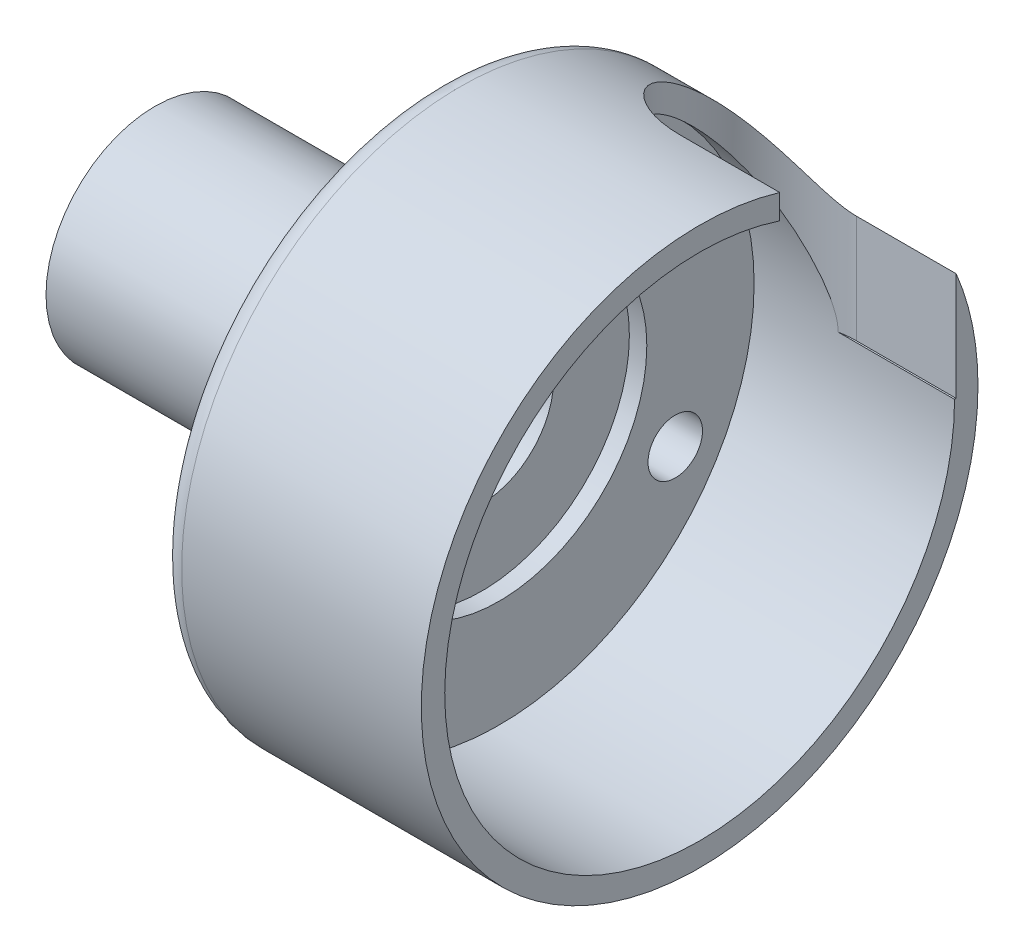
ISO-10303-21;
HEADER;
FILE_DESCRIPTION(('STEP AP214'),'2;1');
FILE_NAME('part.step','',(''),(''),'','','');
FILE_SCHEMA(('AUTOMOTIVE_DESIGN { 1 0 10303 214 1 1 1 1 }'));
ENDSEC;
DATA;
#1=APPLICATION_CONTEXT('core data for automotive mechanical design processes');
#2=APPLICATION_PROTOCOL_DEFINITION('international standard','automotive_design',2000,#1);
#3=PRODUCT_CONTEXT('',#1,'mechanical');
#4=PRODUCT('Part','Part','',(#3));
#5=PRODUCT_RELATED_PRODUCT_CATEGORY('part','',(#4));
#6=PRODUCT_DEFINITION_FORMATION('','',#4);
#7=PRODUCT_DEFINITION_CONTEXT('part definition',#1,'design');
#8=PRODUCT_DEFINITION('design','',#6,#7);
#9=PRODUCT_DEFINITION_SHAPE('','',#8);
#10=(LENGTH_UNIT() NAMED_UNIT(*) SI_UNIT(.MILLI.,.METRE.));
#11=(NAMED_UNIT(*) PLANE_ANGLE_UNIT() SI_UNIT($,.RADIAN.));
#12=(NAMED_UNIT(*) SI_UNIT($,.STERADIAN.) SOLID_ANGLE_UNIT());
#13=UNCERTAINTY_MEASURE_WITH_UNIT(LENGTH_MEASURE(1.E-05),#10,'distance_accuracy_value','');
#14=(GEOMETRIC_REPRESENTATION_CONTEXT(3) GLOBAL_UNCERTAINTY_ASSIGNED_CONTEXT((#13)) GLOBAL_UNIT_ASSIGNED_CONTEXT((#10,
#11,#12)) REPRESENTATION_CONTEXT('',''));
#15=CARTESIAN_POINT('',(0.,0.,0.));
#16=DIRECTION('',(0.,0.,1.));
#17=DIRECTION('',(1.,0.,0.));
#18=AXIS2_PLACEMENT_3D('',#15,#16,#17);
#19=CARTESIAN_POINT('',(-5.,0.,0.));
#20=DIRECTION('',(1.,0.,0.));
#21=DIRECTION('',(0.,0.,-1.));
#22=AXIS2_PLACEMENT_3D('',#19,#20,#21);
#23=CYLINDRICAL_SURFACE('',#22,3.3);
#24=CARTESIAN_POINT('',(10.,0.,0.));
#25=DIRECTION('',(1.,0.,0.));
#26=DIRECTION('',(0.,0.,-1.));
#27=AXIS2_PLACEMENT_3D('',#24,#25,#26);
#28=CIRCLE('',#27,3.3);
#29=CARTESIAN_POINT('',(10.,0.,-3.3));
#30=VERTEX_POINT('',#29);
#31=EDGE_CURVE('E241',#30,#30,#28,.T.);
#32=ORIENTED_EDGE('',*,*,#31,.T.);
#33=EDGE_LOOP('',(#32));
#34=FACE_BOUND('',#33,.T.);
#35=CARTESIAN_POINT('',(9.00000000000001,0.,0.));
#36=DIRECTION('',(-1.,0.,0.));
#37=DIRECTION('',(0.,0.,1.));
#38=AXIS2_PLACEMENT_3D('',#35,#36,#37);
#39=CIRCLE('',#38,3.3);
#40=CARTESIAN_POINT('',(9.00000000000001,0.,3.3));
#41=VERTEX_POINT('',#40);
#42=EDGE_CURVE('E65',#41,#41,#39,.F.);
#43=ORIENTED_EDGE('',*,*,#42,.F.);
#44=EDGE_LOOP('',(#43));
#45=FACE_BOUND('',#44,.T.);
#46=ADVANCED_FACE('F61',(#34,#45),#23,.F.);
#47=CARTESIAN_POINT('',(20.,0.,0.));
#48=DIRECTION('',(1.,0.,0.));
#49=DIRECTION('',(0.,0.,-1.));
#50=AXIS2_PLACEMENT_3D('',#47,#48,#49);
#51=PLANE('',#50);
#52=CARTESIAN_POINT('',(20.,0.,0.));
#53=DIRECTION('',(1.,0.,0.));
#54=DIRECTION('',(0.,0.,-1.));
#55=AXIS2_PLACEMENT_3D('',#52,#53,#54);
#56=CIRCLE('',#55,11.7);
#57=CARTESIAN_POINT('',(20.,11.1078519525604,-3.675));
#58=VERTEX_POINT('',#57);
#59=CARTESIAN_POINT('',(20.,0.,-11.7));
#60=VERTEX_POINT('',#59);
#61=EDGE_CURVE('E436',#58,#60,#56,.T.);
#62=ORIENTED_EDGE('',*,*,#61,.F.);
#63=DIRECTION('',(0.,-1.,0.));
#64=VECTOR('',#63,1.);
#65=CARTESIAN_POINT('',(20.,16.,-3.675));
#66=LINE('',#65,#64);
#67=CARTESIAN_POINT('',(20.,12.234990805064,-3.675));
#68=VERTEX_POINT('',#67);
#69=EDGE_CURVE('E127',#68,#58,#66,.T.);
#70=ORIENTED_EDGE('',*,*,#69,.F.);
#71=CARTESIAN_POINT('',(20.,0.,0.));
#72=DIRECTION('',(1.,0.,0.));
#73=DIRECTION('',(0.,0.,-1.));
#74=AXIS2_PLACEMENT_3D('',#71,#72,#73);
#75=CIRCLE('',#74,12.775);
#76=CARTESIAN_POINT('',(20.,4.954795656735,-11.775));
#77=VERTEX_POINT('',#76);
#78=EDGE_CURVE('E126',#68,#77,#75,.T.);
#79=ORIENTED_EDGE('',*,*,#78,.T.);
#80=DIRECTION('',(0.,-1.,0.));
#81=VECTOR('',#80,1.);
#82=CARTESIAN_POINT('',(20.,16.,-11.775));
#83=LINE('',#82,#81);
#84=CARTESIAN_POINT('',(20.,0.,-11.775));
#85=VERTEX_POINT('',#84);
#86=EDGE_CURVE('E119',#77,#85,#83,.T.);
#87=ORIENTED_EDGE('',*,*,#86,.T.);
#88=DIRECTION('',(0.,0.,1.));
#89=VECTOR('',#88,1.);
#90=CARTESIAN_POINT('',(20.,0.,-11.775));
#91=LINE('',#90,#89);
#92=EDGE_CURVE('E107',#85,#60,#91,.T.);
#93=ORIENTED_EDGE('',*,*,#92,.T.);
#94=EDGE_LOOP('',(#62,#70,#79,#87,#93));
#95=FACE_BOUND('',#94,.T.);
#96=ADVANCED_FACE('F123',(#95),#51,.T.);
#97=CARTESIAN_POINT('',(-22.2925973595304,0.,0.));
#98=DIRECTION('',(1.,0.,0.));
#99=DIRECTION('',(0.,0.,-1.));
#100=AXIS2_PLACEMENT_3D('',#97,#98,#99);
#101=CYLINDRICAL_SURFACE('',#100,11.7);
#102=CARTESIAN_POINT('',(10.8,0.,0.));
#103=DIRECTION('',(1.,0.,0.));
#104=DIRECTION('',(0.,0.,-1.));
#105=AXIS2_PLACEMENT_3D('',#102,#103,#104);
#106=CIRCLE('',#105,11.7);
#107=CARTESIAN_POINT('',(10.8,0.,-11.7));
#108=VERTEX_POINT('',#107);
#109=EDGE_CURVE('E437',#108,#108,#106,.F.);
#110=ORIENTED_EDGE('',*,*,#109,.T.);
#111=EDGE_LOOP('',(#110));
#112=FACE_BOUND('',#111,.T.);
#113=DIRECTION('',(1.,0.,0.));
#114=VECTOR('',#113,1.);
#115=CARTESIAN_POINT('',(-22.2925973595304,11.1078519525604,-3.675));
#116=LINE('',#115,#114);
#117=CARTESIAN_POINT('',(15.4300719305149,11.1078519525604,-3.675));
#118=VERTEX_POINT('',#117);
#119=EDGE_CURVE('E12',#58,#118,#116,.F.);
#120=ORIENTED_EDGE('',*,*,#119,.F.);
#121=ORIENTED_EDGE('',*,*,#61,.T.);
#122=DIRECTION('',(1.,0.,0.));
#123=VECTOR('',#122,1.);
#124=CARTESIAN_POINT('',(-22.2925973595304,0.,-11.7));
#125=LINE('',#124,#123);
#126=CARTESIAN_POINT('',(14.6542658980557,0.,-11.7));
#127=VERTEX_POINT('',#126);
#128=EDGE_CURVE('E112',#127,#60,#125,.T.);
#129=ORIENTED_EDGE('',*,*,#128,.F.);
#130=CARTESIAN_POINT('',(15.4300719305149,11.1078519525604,-3.675));
#131=CARTESIAN_POINT('',(15.321874357469,11.1078448137557,-3.67498552687792));
#132=CARTESIAN_POINT('',(15.2136782804234,11.1064172853442,-3.67933520948674));
#133=CARTESIAN_POINT('',(14.9980606494924,11.1006696657326,-3.69665890445622));
#134=CARTESIAN_POINT('',(14.8906390620478,11.0963497006348,-3.70963254083601));
#135=CARTESIAN_POINT('',(14.6774242912556,11.0847704243369,-3.74408532582627));
#136=CARTESIAN_POINT('',(14.5716297842871,11.0775136495638,-3.76555713449037));
#137=CARTESIAN_POINT('',(14.3623289609946,11.0599628707838,-3.81679957797082));
#138=CARTESIAN_POINT('',(14.2588226097493,11.049668913164,-3.84657008604012));
#139=CARTESIAN_POINT('',(14.0547931684851,11.0259147585262,-3.91413900220891));
#140=CARTESIAN_POINT('',(13.9542712375576,11.0124533489881,-3.95194048407501));
#141=CARTESIAN_POINT('',(13.7569264810491,10.9822151758271,-4.0352089751864));
#142=CARTESIAN_POINT('',(13.6601050264642,10.965437197383,-4.08067879235641));
#143=CARTESIAN_POINT('',(13.4709421983971,10.9284269946721,-4.17878309954883));
#144=CARTESIAN_POINT('',(13.3785976941289,10.9081972303655,-4.23141248183622));
#145=CARTESIAN_POINT('',(13.1989062753842,10.8641149774511,-4.34334239082116));
#146=CARTESIAN_POINT('',(13.1115612094694,10.8402611605978,-4.40264536136992));
#147=CARTESIAN_POINT('',(12.9423726209153,10.7887708307644,-4.52735884454252));
#148=CARTESIAN_POINT('',(12.8605353188507,10.7611301442932,-4.59277607002198));
#149=CARTESIAN_POINT('',(12.7029250624789,10.7019664310599,-4.72899872870154));
#150=CARTESIAN_POINT('',(12.6271543043419,10.6704420087244,-4.79980609527089));
#151=CARTESIAN_POINT('',(12.482118970827,10.6034547126697,-4.94602985375144));
#152=CARTESIAN_POINT('',(12.4128529538663,10.5679927154171,-5.02144521829218));
#153=CARTESIAN_POINT('',(12.2810741934953,10.4930870709412,-5.17614852903445));
#154=CARTESIAN_POINT('',(12.2185639855313,10.4536419395217,-5.25543791305136));
#155=CARTESIAN_POINT('',(12.0988340776575,10.3696272488956,-5.41936730125553));
#156=CARTESIAN_POINT('',(12.0418142838359,10.3249442200007,-5.50409523771966));
#157=CARTESIAN_POINT('',(11.9352006229624,10.231481696717,-5.67594740760889));
#158=CARTESIAN_POINT('',(11.8856094577103,10.1827007219203,-5.76307249931097));
#159=CARTESIAN_POINT('',(11.7479919389348,10.0304128845363,-6.02675993975707));
#160=CARTESIAN_POINT('',(11.6710341065358,9.92089946784347,-6.20575651932947));
#161=CARTESIAN_POINT('',(11.53921610847,9.67611794763069,-6.58163404240134));
#162=CARTESIAN_POINT('',(11.4872578914085,9.53937796679476,-6.7785498304953));
#163=CARTESIAN_POINT('',(11.4138077394232,9.25101562171613,-7.16709855321967));
#164=CARTESIAN_POINT('',(11.3923345402653,9.09938416647827,-7.35872816815356));
#165=CARTESIAN_POINT('',(11.3776043255917,8.81910089336532,-7.69088323482363));
#166=CARTESIAN_POINT('',(11.379124453972,8.69286147619829,-7.83327815203036));
#167=CARTESIAN_POINT('',(11.3961354997653,8.43398843227,-8.11134514872891));
#168=CARTESIAN_POINT('',(11.411632545795,8.30135202469889,-8.24701425154406));
#169=CARTESIAN_POINT('',(11.4548337419917,8.03040139340595,-8.5110832104586));
#170=CARTESIAN_POINT('',(11.4825651007312,7.89207514101251,-8.63946614007853));
#171=CARTESIAN_POINT('',(11.5485755572088,7.61085413971097,-8.88820294958323));
#172=CARTESIAN_POINT('',(11.5868545588686,7.46795943242737,-9.0085569025915));
#173=CARTESIAN_POINT('',(11.6922648875331,7.11135313798653,-9.2947484208774));
#174=CARTESIAN_POINT('',(11.7645568598733,6.89541200487178,-9.4559236479076));
#175=CARTESIAN_POINT('',(11.9246003485401,6.45688903981087,-9.76063319470439));
#176=CARTESIAN_POINT('',(12.0123595813919,6.23430393948547,-9.90415864813986));
#177=CARTESIAN_POINT('',(12.2000435751838,5.78391399409746,-10.1737505484756));
#178=CARTESIAN_POINT('',(12.2999647888715,5.55611068667703,-10.2998220632982));
#179=CARTESIAN_POINT('',(12.5092163718453,5.09621124956749,-10.534957449911));
#180=CARTESIAN_POINT('',(12.6185446722719,4.86411607254096,-10.6440250465372));
#181=CARTESIAN_POINT('',(12.8277125089724,4.43033637143341,-10.8309495438246));
#182=CARTESIAN_POINT('',(12.9266114998205,4.22915167930686,-10.9110384456941));
#183=CARTESIAN_POINT('',(13.1280007184286,3.82425218293121,-11.0594573665479));
#184=CARTESIAN_POINT('',(13.2304911087491,3.62053726442442,-11.1277868524259));
#185=CARTESIAN_POINT('',(13.4377113527418,3.2098726704605,-11.2531313742553));
#186=CARTESIAN_POINT('',(13.5424475670153,3.00291443440759,-11.3101076747649));
#187=CARTESIAN_POINT('',(13.751580027422,2.58608148099421,-11.412636979699));
#188=CARTESIAN_POINT('',(13.8559763679308,2.37620767713658,-11.458193480607));
#189=CARTESIAN_POINT('',(14.0163476692944,2.04379096285069,-11.5207603221632));
#190=CARTESIAN_POINT('',(14.0737703418485,1.92266038120232,-11.5416039116953));
#191=CARTESIAN_POINT('',(14.1859228431972,1.67859844764865,-11.5796186953345));
#192=CARTESIAN_POINT('',(14.2406531601851,1.55566742749431,-11.5967905571242));
#193=CARTESIAN_POINT('',(14.3448221704693,1.30849268850074,-11.6272613762697));
#194=CARTESIAN_POINT('',(14.3943068691404,1.18427311777827,-11.6405961397017));
#195=CARTESIAN_POINT('',(14.4849762527032,0.932561413433722,-11.6634595495844));
#196=CARTESIAN_POINT('',(14.5261714410956,0.805073654890283,-11.6729930278154));
#197=CARTESIAN_POINT('',(14.5889900223494,0.565989043937799,-11.6868145682267));
#198=CARTESIAN_POINT('',(14.612659380525,0.454999146570424,-11.6916873191988));
#199=CARTESIAN_POINT('',(14.6371821680639,0.286193464371981,-11.6966367778539));
#200=CARTESIAN_POINT('',(14.6435303246998,0.2292114866861,-11.6978935986054));
#201=CARTESIAN_POINT('',(14.6520978220564,0.114830471088762,-11.6995771020297));
#202=CARTESIAN_POINT('',(14.6543099801694,0.057430881106254,-11.7000023406291));
#203=CARTESIAN_POINT('',(14.6542658980557,0.,-11.7));
#204=B_SPLINE_CURVE_WITH_KNOTS('',3,(#130,#131,#132,#133,#134,#135,#136,#137,#138,#139,#140,
#141,#142,#143,#144,#145,#146,#147,#148,#149,#150,#151,#152,#153,#154,#155,#156,#157,#158,#159,
#160,#161,#162,#163,#164,#165,#166,#167,#168,#169,#170,#171,#172,#173,#174,#175,#176,#177,#178,
#179,#180,#181,#182,#183,#184,#185,#186,#187,#188,#189,#190,#191,#192,#193,#194,#195,#196,#197,
#198,#199,#200,#201,#202,#203),.UNSPECIFIED.,.F.,.F.,(4,2,2,2,2,2,2,2,2,2,2,2,2,2,2,2,2,2,2,2,2,
2,2,2,2,2,2,2,2,2,2,2,2,2,2,2,4),(0.,0.324493843286334,0.648973540454027,0.973173591110084,
1.29736869049004,1.62168809622833,1.94612651732118,2.27033468156188,2.59466195874875,
2.91934959476239,3.24415424553152,3.56888674227139,3.89374069055089,4.22779245409338,
4.56196541914957,5.22982968361078,5.96309567763883,6.69681213430079,7.26696933938862,
7.83737666934317,8.40905900564491,8.98073613466804,9.81641443947229,10.6525108455413,
11.4883639713546,12.3240337391983,13.0378648856676,13.751728384734,14.4679872805049,
15.1840266054581,15.5909520047519,15.9978033439639,16.4007249333238,16.8031327273289,
17.1430457162478,17.3149437241322,17.4871399751646),.UNSPECIFIED.);
#205=EDGE_CURVE('E70',#118,#127,#204,.T.);
#206=ORIENTED_EDGE('',*,*,#205,.F.);
#207=EDGE_LOOP('',(#120,#121,#129,#206));
#208=FACE_BOUND('',#207,.T.);
#209=ADVANCED_FACE('F169',(#112,#208),#101,.F.);
#210=CARTESIAN_POINT('',(10.,0.,0.));
#211=DIRECTION('',(1.,0.,0.));
#212=DIRECTION('',(0.,0.,-1.));
#213=AXIS2_PLACEMENT_3D('',#210,#211,#212);
#214=PLANE('',#213);
#215=ORIENTED_EDGE('',*,*,#31,.F.);
#216=EDGE_LOOP('',(#215));
#217=FACE_BOUND('',#216,.T.);
#218=CARTESIAN_POINT('',(10.,0.,0.));
#219=DIRECTION('',(1.,0.,0.));
#220=DIRECTION('',(0.,0.,-1.));
#221=AXIS2_PLACEMENT_3D('',#218,#219,#220);
#222=CIRCLE('',#221,6.775);
#223=CARTESIAN_POINT('',(10.,0.,-6.775));
#224=VERTEX_POINT('',#223);
#225=EDGE_CURVE('E246',#224,#224,#222,.T.);
#226=ORIENTED_EDGE('',*,*,#225,.T.);
#227=EDGE_LOOP('',(#226));
#228=FACE_BOUND('',#227,.T.);
#229=ADVANCED_FACE('F173',(#217,#228),#214,.T.);
#230=CARTESIAN_POINT('',(-5.,0.,0.));
#231=DIRECTION('',(1.,0.,0.));
#232=DIRECTION('',(0.,0.,-1.));
#233=AXIS2_PLACEMENT_3D('',#230,#231,#232);
#234=CYLINDRICAL_SURFACE('',#233,5.);
#235=CARTESIAN_POINT('',(-5.,0.,0.));
#236=DIRECTION('',(1.,0.,0.));
#237=DIRECTION('',(0.,0.,-1.));
#238=AXIS2_PLACEMENT_3D('',#235,#236,#237);
#239=CIRCLE('',#238,5.);
#240=CARTESIAN_POINT('',(-5.,0.,-5.));
#241=VERTEX_POINT('',#240);
#242=EDGE_CURVE('E236',#241,#241,#239,.T.);
#243=ORIENTED_EDGE('',*,*,#242,.T.);
#244=EDGE_LOOP('',(#243));
#245=FACE_BOUND('',#244,.T.);
#246=CARTESIAN_POINT('',(8.,0.,0.));
#247=DIRECTION('',(1.,0.,0.));
#248=DIRECTION('',(0.,0.,-1.));
#249=AXIS2_PLACEMENT_3D('',#246,#247,#248);
#250=CIRCLE('',#249,5.);
#251=CARTESIAN_POINT('',(8.,0.,-5.));
#252=VERTEX_POINT('',#251);
#253=EDGE_CURVE('E239',#252,#252,#250,.F.);
#254=ORIENTED_EDGE('',*,*,#253,.T.);
#255=EDGE_LOOP('',(#254));
#256=FACE_BOUND('',#255,.T.);
#257=ADVANCED_FACE('F225',(#245,#256),#234,.T.);
#258=CARTESIAN_POINT('',(-5.,0.,0.));
#259=DIRECTION('',(1.,0.,0.));
#260=DIRECTION('',(0.,0.,-1.));
#261=AXIS2_PLACEMENT_3D('',#258,#259,#260);
#262=PLANE('',#261);
#263=CARTESIAN_POINT('',(-5.,0.,0.));
#264=DIRECTION('',(-1.,0.,0.));
#265=DIRECTION('',(0.,0.,1.));
#266=AXIS2_PLACEMENT_3D('',#263,#264,#265);
#267=CIRCLE('',#266,4.);
#268=CARTESIAN_POINT('',(-5.,0.,4.));
#269=VERTEX_POINT('',#268);
#270=EDGE_CURVE('E427',#269,#269,#267,.T.);
#271=ORIENTED_EDGE('',*,*,#270,.F.);
#272=EDGE_LOOP('',(#271));
#273=FACE_BOUND('',#272,.T.);
#274=ORIENTED_EDGE('',*,*,#242,.F.);
#275=EDGE_LOOP('',(#274));
#276=FACE_BOUND('',#275,.T.);
#277=ADVANCED_FACE('F223',(#273,#276),#262,.F.);
#278=CARTESIAN_POINT('',(8.,0.,0.));
#279=DIRECTION('',(1.,0.,0.));
#280=DIRECTION('',(0.,0.,-1.));
#281=AXIS2_PLACEMENT_3D('',#278,#279,#280);
#282=PLANE('',#281);
#283=CARTESIAN_POINT('',(8.,0.,0.));
#284=DIRECTION('',(1.,0.,0.));
#285=DIRECTION('',(0.,0.,-1.));
#286=AXIS2_PLACEMENT_3D('',#283,#284,#285);
#287=CIRCLE('',#286,11.775);
#288=CARTESIAN_POINT('',(8.,0.,-11.775));
#289=VERTEX_POINT('',#288);
#290=EDGE_CURVE('E253',#289,#289,#287,.F.);
#291=ORIENTED_EDGE('',*,*,#290,.T.);
#292=EDGE_LOOP('',(#291));
#293=FACE_BOUND('',#292,.T.);
#294=ORIENTED_EDGE('',*,*,#253,.F.);
#295=EDGE_LOOP('',(#294));
#296=FACE_BOUND('',#295,.T.);
#297=ADVANCED_FACE('F210',(#293,#296),#282,.F.);
#298=CARTESIAN_POINT('',(8.,0.,0.));
#299=DIRECTION('',(1.,0.,0.));
#300=DIRECTION('',(0.,0.,-1.));
#301=AXIS2_PLACEMENT_3D('',#298,#299,#300);
#302=CYLINDRICAL_SURFACE('',#301,12.775);
#303=DIRECTION('',(1.,0.,0.));
#304=VECTOR('',#303,1.);
#305=CARTESIAN_POINT('',(8.00000000000001,4.95479565673499,-11.775));
#306=LINE('',#305,#304);
#307=CARTESIAN_POINT('',(15.4300719305149,4.954795656735,-11.775));
#308=VERTEX_POINT('',#307);
#309=EDGE_CURVE('E85',#77,#308,#306,.F.);
#310=ORIENTED_EDGE('',*,*,#309,.F.);
#311=ORIENTED_EDGE('',*,*,#78,.F.);
#312=DIRECTION('',(1.,0.,0.));
#313=VECTOR('',#312,1.);
#314=CARTESIAN_POINT('',(8.,12.234990805064,-3.675));
#315=LINE('',#314,#313);
#316=CARTESIAN_POINT('',(15.4300719305149,12.234990805064,-3.675));
#317=VERTEX_POINT('',#316);
#318=EDGE_CURVE('E134',#68,#317,#315,.F.);
#319=ORIENTED_EDGE('',*,*,#318,.T.);
#320=CARTESIAN_POINT('',(15.4300719305149,12.234990805064,-3.675));
#321=CARTESIAN_POINT('',(15.3209331471853,12.234984045307,-3.67498583358514));
#322=CARTESIAN_POINT('',(15.2117959017638,12.2336655392509,-3.67941098492061));
#323=CARTESIAN_POINT('',(14.9943026022523,12.2283560286608,-3.6970380817084));
#324=CARTESIAN_POINT('',(14.8859465137105,12.2243651427261,-3.71023963766665));
#325=CARTESIAN_POINT('',(14.6708744450499,12.2136663827676,-3.74530294439951));
#326=CARTESIAN_POINT('',(14.5641571602142,12.2069608003351,-3.76715739055855));
#327=CARTESIAN_POINT('',(14.3530300604128,12.1907398060429,-3.81932434510254));
#328=CARTESIAN_POINT('',(14.2486202113645,12.1812244357158,-3.84963672846712));
#329=CARTESIAN_POINT('',(14.0428106007343,12.1592613741932,-3.91845509230125));
#330=CARTESIAN_POINT('',(13.9414119614849,12.1468126047366,-3.95696408518206));
#331=CARTESIAN_POINT('',(13.7423456042829,12.1188400980153,-4.04182325481384));
#332=CARTESIAN_POINT('',(13.6446792702618,12.1033152330875,-4.08817630619919));
#333=CARTESIAN_POINT('',(13.4538650465589,12.0690555467578,-4.18823540936472));
#334=CARTESIAN_POINT('',(13.360714098302,12.0503229382914,-4.2419363869115));
#335=CARTESIAN_POINT('',(13.1794593939029,12.0094843365914,-4.3562130591165));
#336=CARTESIAN_POINT('',(13.0913575059105,11.9873771056921,-4.41679127395061));
#337=CARTESIAN_POINT('',(12.9207282347335,11.9396346189753,-4.54426948513484));
#338=CARTESIAN_POINT('',(12.8382064268129,11.9139959101703,-4.61117564847631));
#339=CARTESIAN_POINT('',(12.6793057666344,11.8590847958972,-4.7506155126085));
#340=CARTESIAN_POINT('',(12.6029291445904,11.8298110809262,-4.82315123788722));
#341=CARTESIAN_POINT('',(12.4567845467253,11.7675657920641,-4.973088079405));
#342=CARTESIAN_POINT('',(12.3870150295869,11.7345950845533,-5.05048805385937));
#343=CARTESIAN_POINT('',(12.2543585137771,11.6649021977637,-5.20943528589755));
#344=CARTESIAN_POINT('',(12.1914740961368,11.6281786215456,-5.29098408209374));
#345=CARTESIAN_POINT('',(12.0713730234259,11.5500466590375,-5.45947532311347));
#346=CARTESIAN_POINT('',(12.014333535773,11.5085453534969,-5.546501051891));
#347=CARTESIAN_POINT('',(11.9078385070497,11.4216833550459,-5.72324213042907));
#348=CARTESIAN_POINT('',(11.8583857280252,11.3763212658645,-5.81295844559107));
#349=CARTESIAN_POINT('',(11.7214901506864,11.2346130513023,-6.08487313734174));
#350=CARTESIAN_POINT('',(11.6454183511347,11.1325851455843,-6.26996819588885));
#351=CARTESIAN_POINT('',(11.5174798087419,10.9055873035184,-6.6575917226026));
#352=CARTESIAN_POINT('',(11.468243573072,10.7794009557001,-6.8602557924575));
#353=CARTESIAN_POINT('',(11.401515195475,10.5131644130104,-7.26168316940139));
#354=CARTESIAN_POINT('',(11.3840406347638,10.3731065849813,-7.46044425587755));
#355=CARTESIAN_POINT('',(11.378210474965,10.1207210597664,-7.7976575551745));
#356=CARTESIAN_POINT('',(11.3833174136111,10.0109941143611,-7.93802315881763));
#357=CARTESIAN_POINT('',(11.4072529069467,9.78633642357235,-8.21339174999015));
#358=CARTESIAN_POINT('',(11.4260865019618,9.67140378123861,-8.34839274846963));
#359=CARTESIAN_POINT('',(11.4762155729429,9.4370000355987,-8.61248587842028));
#360=CARTESIAN_POINT('',(11.507538433729,9.31751948446168,-8.74156432554272));
#361=CARTESIAN_POINT('',(11.5814568660812,9.07507698517779,-8.99300347592304));
#362=CARTESIAN_POINT('',(11.6240522446071,8.9521150966805,-9.11536429417596));
#363=CARTESIAN_POINT('',(11.7333042778936,8.66752007182856,-9.38743051651246));
#364=CARTESIAN_POINT('',(11.8033571173605,8.5049758916596,-9.53482544044959));
#365=CARTESIAN_POINT('',(11.9588699531055,8.17683730991072,-9.81768365604331));
#366=CARTESIAN_POINT('',(12.0443365093991,8.01124163667383,-9.95314183078553));
#367=CARTESIAN_POINT('',(12.2295722809001,7.67869355822805,-10.2118881365886));
#368=CARTESIAN_POINT('',(12.3293362201354,7.51174167482707,-10.3351807287378));
#369=CARTESIAN_POINT('',(12.5427964751371,7.17825942440535,-10.5695165367571));
#370=CARTESIAN_POINT('',(12.6564857913163,7.01172888821101,-10.6805658538013));
#371=CARTESIAN_POINT('',(12.8457503706469,6.75332492787889,-10.8446052628927));
#372=CARTESIAN_POINT('',(12.9163889420661,6.66049137888795,-10.9018356266862));
#373=CARTESIAN_POINT('',(13.0625960991297,6.47631717665458,-11.0122411501771));
#374=CARTESIAN_POINT('',(13.1381638186771,6.38497626465025,-11.0654170187446));
#375=CARTESIAN_POINT('',(13.2945929946802,6.20466157606615,-11.1675206877688));
#376=CARTESIAN_POINT('',(13.3754486845392,6.11568536494685,-11.2164529847355));
#377=CARTESIAN_POINT('',(13.543161823836,5.94115398452398,-11.3098677295087));
#378=CARTESIAN_POINT('',(13.6300171344399,5.85559761306146,-11.3543517494017));
#379=CARTESIAN_POINT('',(13.8315307506619,5.67030139941646,-11.4482050961358));
#380=CARTESIAN_POINT('',(13.9479778010477,5.57184861721592,-11.4963304113132));
#381=CARTESIAN_POINT('',(14.19366667207,5.38750563411852,-11.583857078148));
#382=CARTESIAN_POINT('',(14.3228938122503,5.30160129360151,-11.6232682750371));
#383=CARTESIAN_POINT('',(14.5509053957978,5.17610011278596,-11.6795420262578));
#384=CARTESIAN_POINT('',(14.6456021728681,5.130588395309,-11.6995498687435));
#385=CARTESIAN_POINT('',(14.8412768071027,5.05318192210733,-11.7331905189939));
#386=CARTESIAN_POINT('',(14.9422268722079,5.02123126252115,-11.7468495217166));
#387=CARTESIAN_POINT('',(15.108212055431,4.98399382671327,-11.7626815586283));
#388=CARTESIAN_POINT('',(15.1717861577596,4.97316346953424,-11.7672586799353));
#389=CARTESIAN_POINT('',(15.3002329304008,4.95850995909073,-11.773437197962));
#390=CARTESIAN_POINT('',(15.365110893683,4.95472656462886,-11.7750217111524));
#391=CARTESIAN_POINT('',(15.4300719305149,4.954795656735,-11.775));
#392=B_SPLINE_CURVE_WITH_KNOTS('',3,(#320,#321,#322,#323,#324,#325,#326,#327,#328,#329,#330,
#331,#332,#333,#334,#335,#336,#337,#338,#339,#340,#341,#342,#343,#344,#345,#346,#347,#348,#349,
#350,#351,#352,#353,#354,#355,#356,#357,#358,#359,#360,#361,#362,#363,#364,#365,#366,#367,#368,
#369,#370,#371,#372,#373,#374,#375,#376,#377,#378,#379,#380,#381,#382,#383,#384,#385,#386,#387,
#388,#389,#390,#391),.UNSPECIFIED.,.F.,.F.,(4,2,2,2,2,2,2,2,2,2,2,2,2,2,2,2,2,2,2,2,2,2,2,2,2,2,
2,2,2,2,2,2,2,2,2,4),(0.,0.327316582137119,0.65461863903743,0.981644980487314,1.30866648827772,
1.63580839091195,1.96307044283359,2.29010762844273,2.61726504662847,2.9447446521589,
3.27234257563037,3.59986388722843,3.92750756004008,4.2631994968459,4.59901335837471,
5.27013460340023,5.99872453618325,6.72771764670937,7.26175841344123,7.79599537481126,
8.33141023987086,8.8668159366265,9.55687198516535,10.2472224148196,10.9373187465337,
11.6270696141186,12.0167397855116,12.4063416717194,12.7955255569726,13.1845714091665,
13.6634571904775,14.1417991290579,14.4617583003722,14.7803853561272,14.9739098026567,
15.1685228405213),.UNSPECIFIED.);
#393=EDGE_CURVE('E137',#317,#308,#392,.T.);
#394=ORIENTED_EDGE('',*,*,#393,.T.);
#395=EDGE_LOOP('',(#310,#311,#319,#394));
#396=FACE_BOUND('',#395,.T.);
#397=CARTESIAN_POINT('',(9.,0.,0.));
#398=DIRECTION('',(1.,0.,0.));
#399=DIRECTION('',(0.,0.,-1.));
#400=AXIS2_PLACEMENT_3D('',#397,#398,#399);
#401=CIRCLE('',#400,12.775);
#402=CARTESIAN_POINT('',(9.,0.,-12.775));
#403=VERTEX_POINT('',#402);
#404=EDGE_CURVE('E251',#403,#403,#401,.T.);
#405=ORIENTED_EDGE('',*,*,#404,.T.);
#406=EDGE_LOOP('',(#405));
#407=FACE_BOUND('',#406,.T.);
#408=ADVANCED_FACE('F147',(#396,#407),#302,.T.);
#409=CARTESIAN_POINT('',(10.8,0.,0.));
#410=DIRECTION('',(1.,0.,0.));
#411=DIRECTION('',(0.,0.,-1.));
#412=AXIS2_PLACEMENT_3D('',#409,#410,#411);
#413=PLANE('',#412);
#414=CARTESIAN_POINT('',(10.8,9.33000000000001,0.));
#415=DIRECTION('',(1.,0.,0.));
#416=DIRECTION('',(0.,0.,-1.));
#417=AXIS2_PLACEMENT_3D('',#414,#415,#416);
#418=CIRCLE('',#417,1.25);
#419=CARTESIAN_POINT('',(10.8,9.33000000000001,-1.25));
#420=VERTEX_POINT('',#419);
#421=EDGE_CURVE('E446',#420,#420,#418,.T.);
#422=ORIENTED_EDGE('',*,*,#421,.F.);
#423=EDGE_LOOP('',(#422));
#424=FACE_BOUND('',#423,.T.);
#425=CARTESIAN_POINT('',(10.8,-4.66500000000001,-8.08001701730883));
#426=DIRECTION('',(1.,0.,0.));
#427=DIRECTION('',(0.,0.,-1.));
#428=AXIS2_PLACEMENT_3D('',#425,#426,#427);
#429=CIRCLE('',#428,1.25);
#430=CARTESIAN_POINT('',(10.8,-4.66500000000001,-9.33001701730883));
#431=VERTEX_POINT('',#430);
#432=EDGE_CURVE('E449',#431,#431,#429,.T.);
#433=ORIENTED_EDGE('',*,*,#432,.F.);
#434=EDGE_LOOP('',(#433));
#435=FACE_BOUND('',#434,.T.);
#436=CARTESIAN_POINT('',(10.8,-4.66500000000001,8.08001701730882));
#437=DIRECTION('',(1.,0.,0.));
#438=DIRECTION('',(0.,0.,-1.));
#439=AXIS2_PLACEMENT_3D('',#436,#437,#438);
#440=CIRCLE('',#439,1.25);
#441=CARTESIAN_POINT('',(10.8,-4.66500000000001,6.83001701730882));
#442=VERTEX_POINT('',#441);
#443=EDGE_CURVE('E455',#442,#442,#440,.T.);
#444=ORIENTED_EDGE('',*,*,#443,.F.);
#445=EDGE_LOOP('',(#444));
#446=FACE_BOUND('',#445,.T.);
#447=CARTESIAN_POINT('',(10.8,0.,0.));
#448=DIRECTION('',(1.,0.,0.));
#449=DIRECTION('',(0.,0.,-1.));
#450=AXIS2_PLACEMENT_3D('',#447,#448,#449);
#451=CIRCLE('',#450,6.775);
#452=CARTESIAN_POINT('',(10.8,0.,-6.775));
#453=VERTEX_POINT('',#452);
#454=EDGE_CURVE('E242',#453,#453,#451,.T.);
#455=ORIENTED_EDGE('',*,*,#454,.F.);
#456=EDGE_LOOP('',(#455));
#457=FACE_BOUND('',#456,.T.);
#458=ORIENTED_EDGE('',*,*,#109,.F.);
#459=EDGE_LOOP('',(#458));
#460=FACE_BOUND('',#459,.T.);
#461=ADVANCED_FACE('F203',(#424,#435,#446,#457,#460),#413,.T.);
#462=CARTESIAN_POINT('',(10.8,0.,0.));
#463=DIRECTION('',(-1.,0.,0.));
#464=DIRECTION('',(0.,0.,1.));
#465=AXIS2_PLACEMENT_3D('',#462,#463,#464);
#466=CYLINDRICAL_SURFACE('',#465,6.775);
#467=ORIENTED_EDGE('',*,*,#454,.T.);
#468=EDGE_LOOP('',(#467));
#469=FACE_BOUND('',#468,.T.);
#470=ORIENTED_EDGE('',*,*,#225,.F.);
#471=EDGE_LOOP('',(#470));
#472=FACE_BOUND('',#471,.T.);
#473=ADVANCED_FACE('F197',(#469,#472),#466,.F.);
#474=CARTESIAN_POINT('',(8.05,-4.66500000000001,8.08001701730882));
#475=DIRECTION('',(1.,0.,0.));
#476=DIRECTION('',(0.,0.,-1.));
#477=AXIS2_PLACEMENT_3D('',#474,#475,#476);
#478=CYLINDRICAL_SURFACE('',#477,1.25);
#479=CARTESIAN_POINT('',(8.05,-4.66500000000001,8.08001701730882));
#480=DIRECTION('',(1.,0.,0.));
#481=DIRECTION('',(0.,0.,-1.));
#482=AXIS2_PLACEMENT_3D('',#479,#480,#481);
#483=CIRCLE('',#482,1.25);
#484=CARTESIAN_POINT('',(8.05,-4.66500000000001,6.83001701730882));
#485=VERTEX_POINT('',#484);
#486=EDGE_CURVE('E442',#485,#485,#483,.T.);
#487=ORIENTED_EDGE('',*,*,#486,.F.);
#488=EDGE_LOOP('',(#487));
#489=FACE_BOUND('',#488,.T.);
#490=ORIENTED_EDGE('',*,*,#443,.T.);
#491=EDGE_LOOP('',(#490));
#492=FACE_BOUND('',#491,.T.);
#493=ADVANCED_FACE('F194',(#489,#492),#478,.F.);
#494=CARTESIAN_POINT('',(8.05,-4.66500000000001,8.08001701730882));
#495=DIRECTION('',(1.,0.,0.));
#496=DIRECTION('',(0.,0.,-1.));
#497=AXIS2_PLACEMENT_3D('',#494,#495,#496);
#498=PLANE('',#497);
#499=ORIENTED_EDGE('',*,*,#486,.T.);
#500=EDGE_LOOP('',(#499));
#501=FACE_BOUND('',#500,.T.);
#502=ADVANCED_FACE('F189',(#501),#498,.T.);
#503=CARTESIAN_POINT('',(8.05,-4.66500000000001,-8.08001701730883));
#504=DIRECTION('',(1.,0.,0.));
#505=DIRECTION('',(0.,0.,-1.));
#506=AXIS2_PLACEMENT_3D('',#503,#504,#505);
#507=CYLINDRICAL_SURFACE('',#506,1.25);
#508=CARTESIAN_POINT('',(8.05,-4.66500000000001,-8.08001701730883));
#509=DIRECTION('',(1.,0.,0.));
#510=DIRECTION('',(0.,0.,-1.));
#511=AXIS2_PLACEMENT_3D('',#508,#509,#510);
#512=CIRCLE('',#511,1.25);
#513=CARTESIAN_POINT('',(8.05,-4.66500000000001,-9.33001701730883));
#514=VERTEX_POINT('',#513);
#515=EDGE_CURVE('E452',#514,#514,#512,.T.);
#516=ORIENTED_EDGE('',*,*,#515,.F.);
#517=EDGE_LOOP('',(#516));
#518=FACE_BOUND('',#517,.T.);
#519=ORIENTED_EDGE('',*,*,#432,.T.);
#520=EDGE_LOOP('',(#519));
#521=FACE_BOUND('',#520,.T.);
#522=ADVANCED_FACE('F186',(#518,#521),#507,.F.);
#523=CARTESIAN_POINT('',(8.05,0.,0.));
#524=DIRECTION('',(1.,0.,0.));
#525=DIRECTION('',(0.,0.,-1.));
#526=AXIS2_PLACEMENT_3D('',#523,#524,#525);
#527=PLANE('',#526);
#528=ORIENTED_EDGE('',*,*,#515,.T.);
#529=EDGE_LOOP('',(#528));
#530=FACE_BOUND('',#529,.T.);
#531=ADVANCED_FACE('F184',(#530),#527,.T.);
#532=CARTESIAN_POINT('',(8.05,9.33000000000001,0.));
#533=DIRECTION('',(1.,0.,0.));
#534=DIRECTION('',(0.,0.,-1.));
#535=AXIS2_PLACEMENT_3D('',#532,#533,#534);
#536=CYLINDRICAL_SURFACE('',#535,1.25);
#537=CARTESIAN_POINT('',(8.05,9.33000000000001,0.));
#538=DIRECTION('',(1.,0.,0.));
#539=DIRECTION('',(0.,0.,-1.));
#540=AXIS2_PLACEMENT_3D('',#537,#538,#539);
#541=CIRCLE('',#540,1.25);
#542=CARTESIAN_POINT('',(8.05,9.33000000000001,-1.25));
#543=VERTEX_POINT('',#542);
#544=EDGE_CURVE('E443',#543,#543,#541,.T.);
#545=ORIENTED_EDGE('',*,*,#544,.F.);
#546=EDGE_LOOP('',(#545));
#547=FACE_BOUND('',#546,.T.);
#548=ORIENTED_EDGE('',*,*,#421,.T.);
#549=EDGE_LOOP('',(#548));
#550=FACE_BOUND('',#549,.T.);
#551=ADVANCED_FACE('F180',(#547,#550),#536,.F.);
#552=CARTESIAN_POINT('',(8.05,0.,0.));
#553=DIRECTION('',(1.,0.,0.));
#554=DIRECTION('',(0.,0.,-1.));
#555=AXIS2_PLACEMENT_3D('',#552,#553,#554);
#556=PLANE('',#555);
#557=ORIENTED_EDGE('',*,*,#544,.T.);
#558=EDGE_LOOP('',(#557));
#559=FACE_BOUND('',#558,.T.);
#560=ADVANCED_FACE('F177',(#559),#556,.T.);
#561=CARTESIAN_POINT('',(9.,0.,0.));
#562=DIRECTION('',(1.,0.,0.));
#563=DIRECTION('',(0.,0.,-1.));
#564=AXIS2_PLACEMENT_3D('',#561,#562,#563);
#565=TOROIDAL_SURFACE('',#564,11.775,1.);
#566=ORIENTED_EDGE('',*,*,#290,.F.);
#567=EDGE_LOOP('',(#566));
#568=FACE_BOUND('',#567,.T.);
#569=ORIENTED_EDGE('',*,*,#404,.F.);
#570=EDGE_LOOP('',(#569));
#571=FACE_BOUND('',#570,.T.);
#572=ADVANCED_FACE('F63',(#568,#571),#565,.T.);
#573=CARTESIAN_POINT('',(15.4300719305149,16.,-7.725));
#574=DIRECTION('',(0.,-1.,0.));
#575=DIRECTION('',(0.,0.,-1.));
#576=AXIS2_PLACEMENT_3D('',#573,#574,#575);
#577=CYLINDRICAL_SURFACE('',#576,4.05);
#578=DIRECTION('',(0.,-1.,0.));
#579=VECTOR('',#578,1.);
#580=CARTESIAN_POINT('',(15.4300719305149,16.,-3.675));
#581=LINE('',#580,#579);
#582=EDGE_CURVE('E129',#317,#118,#581,.T.);
#583=ORIENTED_EDGE('',*,*,#582,.T.);
#584=ORIENTED_EDGE('',*,*,#205,.T.);
#585=CARTESIAN_POINT('',(15.4300719305149,0.,-7.725));
#586=DIRECTION('',(0.,1.,0.));
#587=DIRECTION('',(0.,0.,1.));
#588=AXIS2_PLACEMENT_3D('',#585,#586,#587);
#589=CIRCLE('',#588,4.05);
#590=CARTESIAN_POINT('',(15.4300719305149,0.,-11.775));
#591=VERTEX_POINT('',#590);
#592=EDGE_CURVE('E77',#591,#127,#589,.T.);
#593=ORIENTED_EDGE('',*,*,#592,.F.);
#594=DIRECTION('',(0.,-1.,0.));
#595=VECTOR('',#594,1.);
#596=CARTESIAN_POINT('',(15.4300719305149,16.,-11.775));
#597=LINE('',#596,#595);
#598=EDGE_CURVE('E120',#308,#591,#597,.T.);
#599=ORIENTED_EDGE('',*,*,#598,.F.);
#600=ORIENTED_EDGE('',*,*,#393,.F.);
#601=EDGE_LOOP('',(#583,#584,#593,#599,#600));
#602=FACE_BOUND('',#601,.T.);
#603=ADVANCED_FACE('F151',(#602),#577,.F.);
#604=CARTESIAN_POINT('',(15.4300719305149,16.,-3.675));
#605=DIRECTION('',(0.,0.,-1.));
#606=DIRECTION('',(-1.,0.,0.));
#607=AXIS2_PLACEMENT_3D('',#604,#605,#606);
#608=PLANE('',#607);
#609=ORIENTED_EDGE('',*,*,#69,.T.);
#610=ORIENTED_EDGE('',*,*,#119,.T.);
#611=ORIENTED_EDGE('',*,*,#582,.F.);
#612=ORIENTED_EDGE('',*,*,#318,.F.);
#613=EDGE_LOOP('',(#609,#610,#611,#612));
#614=FACE_BOUND('',#613,.T.);
#615=ADVANCED_FACE('F156',(#614),#608,.T.);
#616=CARTESIAN_POINT('',(15.4300719305149,0.,-7.725));
#617=DIRECTION('',(0.,1.,0.));
#618=DIRECTION('',(0.,0.,1.));
#619=AXIS2_PLACEMENT_3D('',#616,#617,#618);
#620=PLANE('',#619);
#621=ORIENTED_EDGE('',*,*,#128,.T.);
#622=ORIENTED_EDGE('',*,*,#92,.F.);
#623=DIRECTION('',(1.,0.,0.));
#624=VECTOR('',#623,1.);
#625=CARTESIAN_POINT('',(15.4300719305149,0.,-11.775));
#626=LINE('',#625,#624);
#627=EDGE_CURVE('E110',#591,#85,#626,.T.);
#628=ORIENTED_EDGE('',*,*,#627,.F.);
#629=ORIENTED_EDGE('',*,*,#592,.T.);
#630=EDGE_LOOP('',(#621,#622,#628,#629));
#631=FACE_BOUND('',#630,.T.);
#632=ADVANCED_FACE('F109',(#631),#620,.T.);
#633=CARTESIAN_POINT('',(15.4300719305149,16.,-11.775));
#634=DIRECTION('',(0.,0.,-1.));
#635=DIRECTION('',(-1.,0.,0.));
#636=AXIS2_PLACEMENT_3D('',#633,#634,#635);
#637=PLANE('',#636);
#638=ORIENTED_EDGE('',*,*,#309,.T.);
#639=ORIENTED_EDGE('',*,*,#598,.T.);
#640=ORIENTED_EDGE('',*,*,#627,.T.);
#641=ORIENTED_EDGE('',*,*,#86,.F.);
#642=EDGE_LOOP('',(#638,#639,#640,#641));
#643=FACE_BOUND('',#642,.T.);
#644=ADVANCED_FACE('F118',(#643),#637,.F.);
#645=CARTESIAN_POINT('',(9.00000000000001,0.,0.));
#646=DIRECTION('',(-1.,0.,0.));
#647=DIRECTION('',(0.,0.,1.));
#648=AXIS2_PLACEMENT_3D('',#645,#646,#647);
#649=PLANE('',#648);
#650=CARTESIAN_POINT('',(9.00000000000001,0.,0.));
#651=DIRECTION('',(-1.,0.,0.));
#652=DIRECTION('',(0.,0.,1.));
#653=AXIS2_PLACEMENT_3D('',#650,#651,#652);
#654=CIRCLE('',#653,4.);
#655=CARTESIAN_POINT('',(9.00000000000001,0.,4.));
#656=VERTEX_POINT('',#655);
#657=EDGE_CURVE('E424',#656,#656,#654,.T.);
#658=ORIENTED_EDGE('',*,*,#657,.T.);
#659=EDGE_LOOP('',(#658));
#660=FACE_BOUND('',#659,.T.);
#661=ORIENTED_EDGE('',*,*,#42,.T.);
#662=EDGE_LOOP('',(#661));
#663=FACE_BOUND('',#662,.T.);
#664=ADVANCED_FACE('F289',(#660,#663),#649,.T.);
#665=CARTESIAN_POINT('',(9.00000000000001,0.,0.));
#666=DIRECTION('',(-1.,0.,0.));
#667=DIRECTION('',(0.,0.,1.));
#668=AXIS2_PLACEMENT_3D('',#665,#666,#667);
#669=CYLINDRICAL_SURFACE('',#668,4.);
#670=ORIENTED_EDGE('',*,*,#657,.F.);
#671=EDGE_LOOP('',(#670));
#672=FACE_BOUND('',#671,.T.);
#673=ORIENTED_EDGE('',*,*,#270,.T.);
#674=EDGE_LOOP('',(#673));
#675=FACE_BOUND('',#674,.T.);
#676=ADVANCED_FACE('F295',(#672,#675),#669,.F.);
#677=CLOSED_SHELL('',(#46,#96,#209,#229,#257,#277,#297,#408,#461,#473,#493,#502,#522,#531,#551,
#560,#572,#603,#615,#632,#644,#664,#676));
#678=MANIFOLD_SOLID_BREP('B2',#677);
#679=ADVANCED_BREP_SHAPE_REPRESENTATION('',(#18,#678),#14);
#680=SHAPE_DEFINITION_REPRESENTATION(#9,#679);
ENDSEC;
END-ISO-10303-21;
